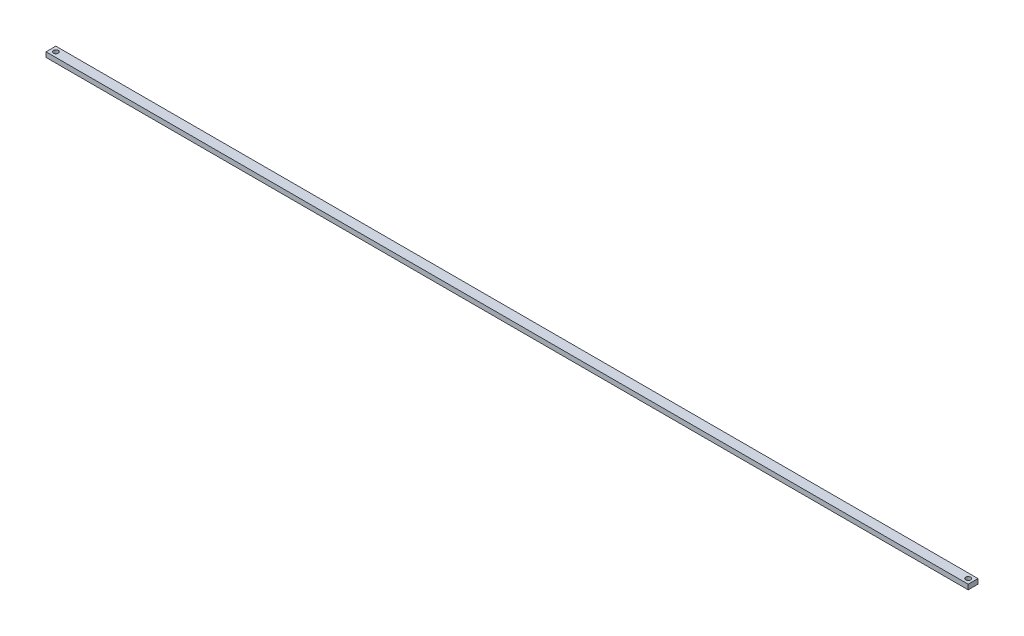
ISO-10303-21;
HEADER;
FILE_DESCRIPTION(('STEP AP214'),'2;1');
FILE_NAME('part.step','',(''),(''),'','','');
FILE_SCHEMA(('AUTOMOTIVE_DESIGN { 1 0 10303 214 1 1 1 1 }'));
ENDSEC;
DATA;
#1=APPLICATION_CONTEXT('core data for automotive mechanical design processes');
#2=APPLICATION_PROTOCOL_DEFINITION('international standard','automotive_design',2000,#1);
#3=PRODUCT_CONTEXT('',#1,'mechanical');
#4=PRODUCT('Part','Part','',(#3));
#5=PRODUCT_RELATED_PRODUCT_CATEGORY('part','',(#4));
#6=PRODUCT_DEFINITION_FORMATION('','',#4);
#7=PRODUCT_DEFINITION_CONTEXT('part definition',#1,'design');
#8=PRODUCT_DEFINITION('design','',#6,#7);
#9=PRODUCT_DEFINITION_SHAPE('','',#8);
#10=(LENGTH_UNIT() NAMED_UNIT(*) SI_UNIT(.MILLI.,.METRE.));
#11=(NAMED_UNIT(*) PLANE_ANGLE_UNIT() SI_UNIT($,.RADIAN.));
#12=(NAMED_UNIT(*) SI_UNIT($,.STERADIAN.) SOLID_ANGLE_UNIT());
#13=UNCERTAINTY_MEASURE_WITH_UNIT(LENGTH_MEASURE(1.E-05),#10,'distance_accuracy_value','');
#14=(GEOMETRIC_REPRESENTATION_CONTEXT(3) GLOBAL_UNCERTAINTY_ASSIGNED_CONTEXT((#13)) GLOBAL_UNIT_ASSIGNED_CONTEXT((#10,
#11,#12)) REPRESENTATION_CONTEXT('',''));
#15=CARTESIAN_POINT('',(0.,0.,0.));
#16=DIRECTION('',(0.,0.,1.));
#17=DIRECTION('',(1.,0.,0.));
#18=AXIS2_PLACEMENT_3D('',#15,#16,#17);
#19=CARTESIAN_POINT('',(0.,3.175,0.));
#20=DIRECTION('',(0.,1.,0.));
#21=DIRECTION('',(0.,0.,1.));
#22=AXIS2_PLACEMENT_3D('',#19,#20,#21);
#23=PLANE('',#22);
#24=CARTESIAN_POINT('',(3.175,3.175,3.175));
#25=DIRECTION('',(0.,1.,0.));
#26=DIRECTION('',(0.,0.,1.));
#27=AXIS2_PLACEMENT_3D('',#24,#25,#26);
#28=CIRCLE('',#27,1.5875);
#29=CARTESIAN_POINT('',(3.175,3.175,4.7625));
#30=VERTEX_POINT('',#29);
#31=EDGE_CURVE('E120',#30,#30,#28,.T.);
#32=ORIENTED_EDGE('',*,*,#31,.F.);
#33=EDGE_LOOP('',(#32));
#34=FACE_BOUND('',#33,.T.);
#35=DIRECTION('',(0.,0.,1.));
#36=VECTOR('',#35,1.);
#37=CARTESIAN_POINT('',(0.,3.175,0.));
#38=LINE('',#37,#36);
#39=CARTESIAN_POINT('',(0.,3.175,0.));
#40=VERTEX_POINT('',#39);
#41=CARTESIAN_POINT('',(0.,3.175,6.35));
#42=VERTEX_POINT('',#41);
#43=EDGE_CURVE('E99',#40,#42,#38,.T.);
#44=ORIENTED_EDGE('',*,*,#43,.T.);
#45=DIRECTION('',(1.,0.,0.));
#46=VECTOR('',#45,1.);
#47=CARTESIAN_POINT('',(0.,3.175,6.35));
#48=LINE('',#47,#46);
#49=CARTESIAN_POINT('',(596.9,3.175,6.35));
#50=VERTEX_POINT('',#49);
#51=EDGE_CURVE('E94',#42,#50,#48,.T.);
#52=ORIENTED_EDGE('',*,*,#51,.T.);
#53=DIRECTION('',(0.,0.,-1.));
#54=VECTOR('',#53,1.);
#55=CARTESIAN_POINT('',(596.9,3.175,0.));
#56=LINE('',#55,#54);
#57=CARTESIAN_POINT('',(596.9,3.175,0.));
#58=VERTEX_POINT('',#57);
#59=EDGE_CURVE('E97',#50,#58,#56,.T.);
#60=ORIENTED_EDGE('',*,*,#59,.T.);
#61=DIRECTION('',(-1.,0.,0.));
#62=VECTOR('',#61,1.);
#63=CARTESIAN_POINT('',(0.,3.175,0.));
#64=LINE('',#63,#62);
#65=EDGE_CURVE('E58',#58,#40,#64,.T.);
#66=ORIENTED_EDGE('',*,*,#65,.T.);
#67=EDGE_LOOP('',(#44,#52,#60,#66));
#68=FACE_BOUND('',#67,.T.);
#69=CARTESIAN_POINT('',(593.725,3.175,3.175));
#70=DIRECTION('',(0.,1.,0.));
#71=DIRECTION('',(0.,0.,-1.));
#72=AXIS2_PLACEMENT_3D('',#69,#70,#71);
#73=CIRCLE('',#72,1.58750000000014);
#74=CARTESIAN_POINT('',(593.725,3.175,1.58749999999985));
#75=VERTEX_POINT('',#74);
#76=EDGE_CURVE('E143',#75,#75,#73,.T.);
#77=ORIENTED_EDGE('',*,*,#76,.F.);
#78=EDGE_LOOP('',(#77));
#79=FACE_BOUND('',#78,.T.);
#80=ADVANCED_FACE('F38',(#34,#68,#79),#23,.T.);
#81=CARTESIAN_POINT('',(0.,0.,0.));
#82=DIRECTION('',(0.,1.,0.));
#83=DIRECTION('',(0.,0.,1.));
#84=AXIS2_PLACEMENT_3D('',#81,#82,#83);
#85=PLANE('',#84);
#86=CARTESIAN_POINT('',(3.175,0.,3.175));
#87=DIRECTION('',(0.,1.,0.));
#88=DIRECTION('',(0.,0.,1.));
#89=AXIS2_PLACEMENT_3D('',#86,#87,#88);
#90=CIRCLE('',#89,1.5875);
#91=CARTESIAN_POINT('',(3.175,0.,4.7625));
#92=VERTEX_POINT('',#91);
#93=EDGE_CURVE('E139',#92,#92,#90,.T.);
#94=ORIENTED_EDGE('',*,*,#93,.T.);
#95=EDGE_LOOP('',(#94));
#96=FACE_BOUND('',#95,.T.);
#97=DIRECTION('',(0.,0.,1.));
#98=VECTOR('',#97,1.);
#99=CARTESIAN_POINT('',(0.,0.,0.));
#100=LINE('',#99,#98);
#101=CARTESIAN_POINT('',(0.,0.,0.));
#102=VERTEX_POINT('',#101);
#103=CARTESIAN_POINT('',(0.,0.,6.35));
#104=VERTEX_POINT('',#103);
#105=EDGE_CURVE('E116',#102,#104,#100,.T.);
#106=ORIENTED_EDGE('',*,*,#105,.F.);
#107=DIRECTION('',(-1.,0.,0.));
#108=VECTOR('',#107,1.);
#109=CARTESIAN_POINT('',(0.,0.,0.));
#110=LINE('',#109,#108);
#111=CARTESIAN_POINT('',(596.9,0.,0.));
#112=VERTEX_POINT('',#111);
#113=EDGE_CURVE('E87',#112,#102,#110,.T.);
#114=ORIENTED_EDGE('',*,*,#113,.F.);
#115=DIRECTION('',(0.,0.,-1.));
#116=VECTOR('',#115,1.);
#117=CARTESIAN_POINT('',(596.9,0.,0.));
#118=LINE('',#117,#116);
#119=CARTESIAN_POINT('',(596.9,0.,6.35));
#120=VERTEX_POINT('',#119);
#121=EDGE_CURVE('E80',#120,#112,#118,.T.);
#122=ORIENTED_EDGE('',*,*,#121,.F.);
#123=DIRECTION('',(1.,0.,0.));
#124=VECTOR('',#123,1.);
#125=CARTESIAN_POINT('',(0.,0.,6.35));
#126=LINE('',#125,#124);
#127=EDGE_CURVE('E104',#104,#120,#126,.T.);
#128=ORIENTED_EDGE('',*,*,#127,.F.);
#129=EDGE_LOOP('',(#106,#114,#122,#128));
#130=FACE_BOUND('',#129,.T.);
#131=CARTESIAN_POINT('',(593.725,0.,3.175));
#132=DIRECTION('',(0.,1.,0.));
#133=DIRECTION('',(0.,0.,-1.));
#134=AXIS2_PLACEMENT_3D('',#131,#132,#133);
#135=CIRCLE('',#134,1.58750000000014);
#136=CARTESIAN_POINT('',(593.725,0.,1.58749999999985));
#137=VERTEX_POINT('',#136);
#138=EDGE_CURVE('E147',#137,#137,#135,.T.);
#139=ORIENTED_EDGE('',*,*,#138,.T.);
#140=EDGE_LOOP('',(#139));
#141=FACE_BOUND('',#140,.T.);
#142=ADVANCED_FACE('F134',(#96,#130,#141),#85,.F.);
#143=CARTESIAN_POINT('',(0.,3.175,0.));
#144=DIRECTION('',(1.,0.,0.));
#145=DIRECTION('',(0.,0.,-1.));
#146=AXIS2_PLACEMENT_3D('',#143,#144,#145);
#147=PLANE('',#146);
#148=ORIENTED_EDGE('',*,*,#105,.T.);
#149=DIRECTION('',(0.,-1.,0.));
#150=VECTOR('',#149,1.);
#151=CARTESIAN_POINT('',(0.,3.175,6.35));
#152=LINE('',#151,#150);
#153=EDGE_CURVE('E11',#42,#104,#152,.T.);
#154=ORIENTED_EDGE('',*,*,#153,.F.);
#155=ORIENTED_EDGE('',*,*,#43,.F.);
#156=DIRECTION('',(0.,-1.,0.));
#157=VECTOR('',#156,1.);
#158=CARTESIAN_POINT('',(0.,3.175,0.));
#159=LINE('',#158,#157);
#160=EDGE_CURVE('E112',#40,#102,#159,.T.);
#161=ORIENTED_EDGE('',*,*,#160,.T.);
#162=EDGE_LOOP('',(#148,#154,#155,#161));
#163=FACE_BOUND('',#162,.T.);
#164=ADVANCED_FACE('F40',(#163),#147,.F.);
#165=CARTESIAN_POINT('',(0.,3.175,6.35));
#166=DIRECTION('',(0.,0.,-1.));
#167=DIRECTION('',(-1.,0.,0.));
#168=AXIS2_PLACEMENT_3D('',#165,#166,#167);
#169=PLANE('',#168);
#170=ORIENTED_EDGE('',*,*,#127,.T.);
#171=DIRECTION('',(0.,-1.,0.));
#172=VECTOR('',#171,1.);
#173=CARTESIAN_POINT('',(596.9,3.175,6.35));
#174=LINE('',#173,#172);
#175=EDGE_CURVE('E48',#50,#120,#174,.T.);
#176=ORIENTED_EDGE('',*,*,#175,.F.);
#177=ORIENTED_EDGE('',*,*,#51,.F.);
#178=ORIENTED_EDGE('',*,*,#153,.T.);
#179=EDGE_LOOP('',(#170,#176,#177,#178));
#180=FACE_BOUND('',#179,.T.);
#181=ADVANCED_FACE('F103',(#180),#169,.F.);
#182=CARTESIAN_POINT('',(596.9,3.175,0.));
#183=DIRECTION('',(-1.,0.,0.));
#184=DIRECTION('',(0.,0.,1.));
#185=AXIS2_PLACEMENT_3D('',#182,#183,#184);
#186=PLANE('',#185);
#187=ORIENTED_EDGE('',*,*,#121,.T.);
#188=DIRECTION('',(0.,-1.,0.));
#189=VECTOR('',#188,1.);
#190=CARTESIAN_POINT('',(596.9,3.175,0.));
#191=LINE('',#190,#189);
#192=EDGE_CURVE('E106',#58,#112,#191,.T.);
#193=ORIENTED_EDGE('',*,*,#192,.F.);
#194=ORIENTED_EDGE('',*,*,#59,.F.);
#195=ORIENTED_EDGE('',*,*,#175,.T.);
#196=EDGE_LOOP('',(#187,#193,#194,#195));
#197=FACE_BOUND('',#196,.T.);
#198=ADVANCED_FACE('F107',(#197),#186,.F.);
#199=CARTESIAN_POINT('',(0.,3.175,0.));
#200=DIRECTION('',(0.,0.,1.));
#201=DIRECTION('',(1.,0.,0.));
#202=AXIS2_PLACEMENT_3D('',#199,#200,#201);
#203=PLANE('',#202);
#204=ORIENTED_EDGE('',*,*,#113,.T.);
#205=ORIENTED_EDGE('',*,*,#160,.F.);
#206=ORIENTED_EDGE('',*,*,#65,.F.);
#207=ORIENTED_EDGE('',*,*,#192,.T.);
#208=EDGE_LOOP('',(#204,#205,#206,#207));
#209=FACE_BOUND('',#208,.T.);
#210=ADVANCED_FACE('F131',(#209),#203,.F.);
#211=CARTESIAN_POINT('',(3.175,3.175,3.175));
#212=DIRECTION('',(0.,-1.,0.));
#213=DIRECTION('',(0.,0.,-1.));
#214=AXIS2_PLACEMENT_3D('',#211,#212,#213);
#215=CYLINDRICAL_SURFACE('',#214,1.5875);
#216=ORIENTED_EDGE('',*,*,#31,.T.);
#217=EDGE_LOOP('',(#216));
#218=FACE_BOUND('',#217,.T.);
#219=ORIENTED_EDGE('',*,*,#93,.F.);
#220=EDGE_LOOP('',(#219));
#221=FACE_BOUND('',#220,.T.);
#222=ADVANCED_FACE('F165',(#218,#221),#215,.F.);
#223=CARTESIAN_POINT('',(593.725,3.175,3.175));
#224=DIRECTION('',(0.,-1.,0.));
#225=DIRECTION('',(0.,0.,-1.));
#226=AXIS2_PLACEMENT_3D('',#223,#224,#225);
#227=CYLINDRICAL_SURFACE('',#226,1.58750000000014);
#228=ORIENTED_EDGE('',*,*,#76,.T.);
#229=EDGE_LOOP('',(#228));
#230=FACE_BOUND('',#229,.T.);
#231=ORIENTED_EDGE('',*,*,#138,.F.);
#232=EDGE_LOOP('',(#231));
#233=FACE_BOUND('',#232,.T.);
#234=ADVANCED_FACE('F153',(#230,#233),#227,.F.);
#235=CLOSED_SHELL('',(#80,#142,#164,#181,#198,#210,#222,#234));
#236=MANIFOLD_SOLID_BREP('B2',#235);
#237=ADVANCED_BREP_SHAPE_REPRESENTATION('',(#18,#236),#14);
#238=SHAPE_DEFINITION_REPRESENTATION(#9,#237);
ENDSEC;
END-ISO-10303-21;
